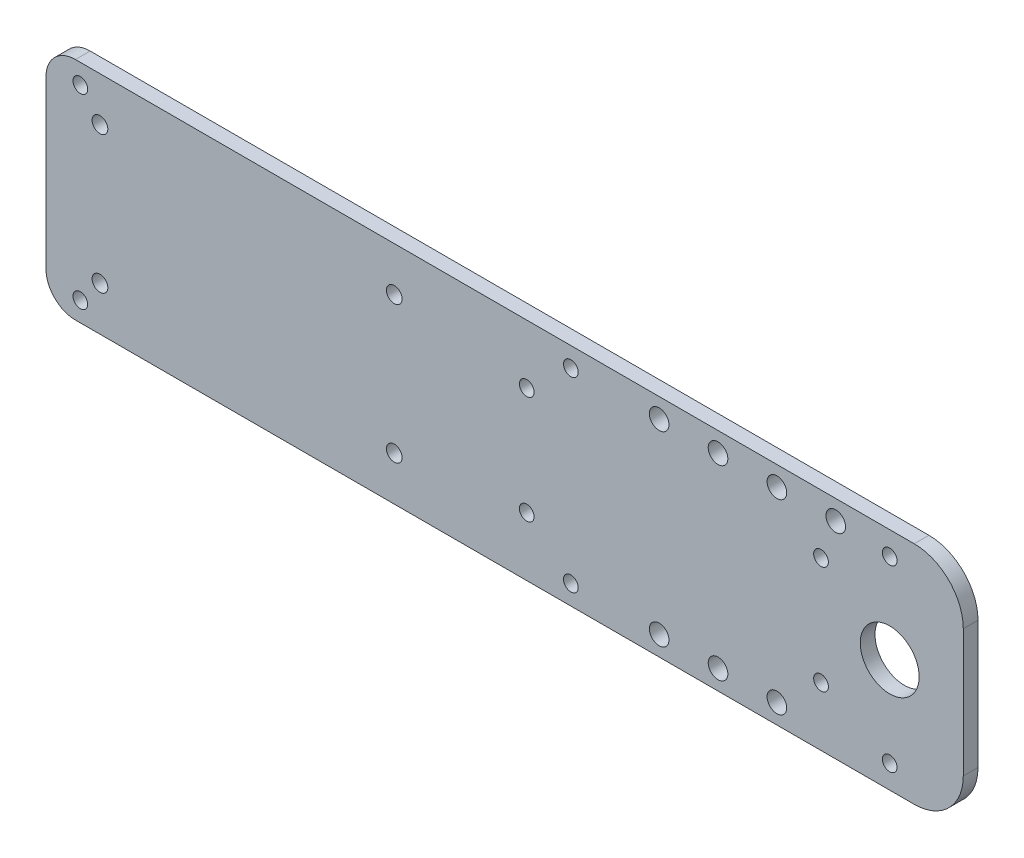
ISO-10303-21;
HEADER;
FILE_DESCRIPTION(('STEP AP214'),'2;1');
FILE_NAME('part.step','',(''),(''),'','','');
FILE_SCHEMA(('AUTOMOTIVE_DESIGN { 1 0 10303 214 1 1 1 1 }'));
ENDSEC;
DATA;
#1=APPLICATION_CONTEXT('core data for automotive mechanical design processes');
#2=APPLICATION_PROTOCOL_DEFINITION('international standard','automotive_design',2000,#1);
#3=PRODUCT_CONTEXT('',#1,'mechanical');
#4=PRODUCT('Part','Part','',(#3));
#5=PRODUCT_RELATED_PRODUCT_CATEGORY('part','',(#4));
#6=PRODUCT_DEFINITION_FORMATION('','',#4);
#7=PRODUCT_DEFINITION_CONTEXT('part definition',#1,'design');
#8=PRODUCT_DEFINITION('design','',#6,#7);
#9=PRODUCT_DEFINITION_SHAPE('','',#8);
#10=(LENGTH_UNIT() NAMED_UNIT(*) SI_UNIT(.MILLI.,.METRE.));
#11=(NAMED_UNIT(*) PLANE_ANGLE_UNIT() SI_UNIT($,.RADIAN.));
#12=(NAMED_UNIT(*) SI_UNIT($,.STERADIAN.) SOLID_ANGLE_UNIT());
#13=UNCERTAINTY_MEASURE_WITH_UNIT(LENGTH_MEASURE(1.E-05),#10,'distance_accuracy_value','');
#14=(GEOMETRIC_REPRESENTATION_CONTEXT(3) GLOBAL_UNCERTAINTY_ASSIGNED_CONTEXT((#13)) GLOBAL_UNIT_ASSIGNED_CONTEXT((#10,
#11,#12)) REPRESENTATION_CONTEXT('',''));
#15=CARTESIAN_POINT('',(0.,0.,0.));
#16=DIRECTION('',(0.,0.,1.));
#17=DIRECTION('',(1.,0.,0.));
#18=AXIS2_PLACEMENT_3D('',#15,#16,#17);
#19=CARTESIAN_POINT('',(0.,0.,3.));
#20=DIRECTION('',(0.,0.,1.));
#21=DIRECTION('',(1.,0.,0.));
#22=AXIS2_PLACEMENT_3D('',#19,#20,#21);
#23=PLANE('',#22);
#24=CARTESIAN_POINT('',(102.,11.,3.));
#25=DIRECTION('',(0.,0.,1.));
#26=DIRECTION('',(1.,0.,0.));
#27=AXIS2_PLACEMENT_3D('',#24,#25,#26);
#28=CIRCLE('',#27,1.5);
#29=CARTESIAN_POINT('',(103.5,11.,3.));
#30=VERTEX_POINT('',#29);
#31=EDGE_CURVE('E318',#30,#30,#28,.F.);
#32=ORIENTED_EDGE('',*,*,#31,.T.);
#33=EDGE_LOOP('',(#32));
#34=FACE_BOUND('',#33,.T.);
#35=CARTESIAN_POINT('',(69.,19.,3.));
#36=DIRECTION('',(0.,0.,1.));
#37=DIRECTION('',(1.,0.,0.));
#38=AXIS2_PLACEMENT_3D('',#35,#36,#37);
#39=CIRCLE('',#38,2.);
#40=CARTESIAN_POINT('',(71.,19.,3.));
#41=VERTEX_POINT('',#40);
#42=EDGE_CURVE('E330',#41,#41,#39,.T.);
#43=ORIENTED_EDGE('',*,*,#42,.F.);
#44=EDGE_LOOP('',(#43));
#45=FACE_BOUND('',#44,.T.);
#46=CARTESIAN_POINT('',(-49.,-19.,3.));
#47=DIRECTION('',(0.,0.,1.));
#48=DIRECTION('',(1.,0.,0.));
#49=AXIS2_PLACEMENT_3D('',#46,#47,#48);
#50=CIRCLE('',#49,1.5);
#51=CARTESIAN_POINT('',(-47.5,-19.,3.));
#52=VERTEX_POINT('',#51);
#53=EDGE_CURVE('E355',#52,#52,#50,.F.);
#54=ORIENTED_EDGE('',*,*,#53,.T.);
#55=EDGE_LOOP('',(#54));
#56=FACE_BOUND('',#55,.T.);
#57=CARTESIAN_POINT('',(69.,-19.,3.));
#58=DIRECTION('',(0.,0.,1.));
#59=DIRECTION('',(1.,0.,0.));
#60=AXIS2_PLACEMENT_3D('',#57,#58,#59);
#61=CIRCLE('',#60,2.);
#62=CARTESIAN_POINT('',(71.,-19.,3.));
#63=VERTEX_POINT('',#62);
#64=EDGE_CURVE('E331',#63,#63,#61,.T.);
#65=ORIENTED_EDGE('',*,*,#64,.F.);
#66=EDGE_LOOP('',(#65));
#67=FACE_BOUND('',#66,.T.);
#68=CARTESIAN_POINT('',(81.,-19.,3.));
#69=DIRECTION('',(0.,0.,1.));
#70=DIRECTION('',(1.,0.,0.));
#71=AXIS2_PLACEMENT_3D('',#68,#69,#70);
#72=CIRCLE('',#71,2.);
#73=CARTESIAN_POINT('',(83.,-19.,3.));
#74=VERTEX_POINT('',#73);
#75=EDGE_CURVE('E337',#74,#74,#72,.T.);
#76=ORIENTED_EDGE('',*,*,#75,.F.);
#77=EDGE_LOOP('',(#76));
#78=FACE_BOUND('',#77,.T.);
#79=CARTESIAN_POINT('',(81.,19.,3.));
#80=DIRECTION('',(0.,0.,1.));
#81=DIRECTION('',(1.,0.,0.));
#82=AXIS2_PLACEMENT_3D('',#79,#80,#81);
#83=CIRCLE('',#82,2.);
#84=CARTESIAN_POINT('',(83.,19.,3.));
#85=VERTEX_POINT('',#84);
#86=EDGE_CURVE('E317',#85,#85,#83,.T.);
#87=ORIENTED_EDGE('',*,*,#86,.F.);
#88=EDGE_LOOP('',(#87));
#89=FACE_BOUND('',#88,.T.);
#90=CARTESIAN_POINT('',(-49.,19.,3.));
#91=DIRECTION('',(0.,0.,1.));
#92=DIRECTION('',(1.,0.,0.));
#93=AXIS2_PLACEMENT_3D('',#90,#91,#92);
#94=CIRCLE('',#93,1.5);
#95=CARTESIAN_POINT('',(-47.5,19.,3.));
#96=VERTEX_POINT('',#95);
#97=EDGE_CURVE('E354',#96,#96,#94,.T.);
#98=ORIENTED_EDGE('',*,*,#97,.F.);
#99=EDGE_LOOP('',(#98));
#100=FACE_BOUND('',#99,.T.);
#101=DIRECTION('',(-1.,0.,0.));
#102=VECTOR('',#101,1.);
#103=CARTESIAN_POINT('',(0.,-23.,3.));
#104=LINE('',#103,#102);
#105=CARTESIAN_POINT('',(121.,-23.,3.));
#106=VERTEX_POINT('',#105);
#107=CARTESIAN_POINT('',(-50.,-23.,3.));
#108=VERTEX_POINT('',#107);
#109=EDGE_CURVE('E124',#106,#108,#104,.T.);
#110=ORIENTED_EDGE('',*,*,#109,.F.);
#111=CARTESIAN_POINT('',(121.,-13.,3.));
#112=DIRECTION('',(0.,0.,1.));
#113=DIRECTION('',(1.,0.,0.));
#114=AXIS2_PLACEMENT_3D('',#111,#112,#113);
#115=CIRCLE('',#114,10.);
#116=CARTESIAN_POINT('',(131.,-13.,3.));
#117=VERTEX_POINT('',#116);
#118=EDGE_CURVE('E151',#106,#117,#115,.T.);
#119=ORIENTED_EDGE('',*,*,#118,.T.);
#120=DIRECTION('',(0.,1.,0.));
#121=VECTOR('',#120,1.);
#122=CARTESIAN_POINT('',(131.,0.,3.));
#123=LINE('',#122,#121);
#124=CARTESIAN_POINT('',(131.,13.,3.));
#125=VERTEX_POINT('',#124);
#126=EDGE_CURVE('E165',#117,#125,#123,.T.);
#127=ORIENTED_EDGE('',*,*,#126,.T.);
#128=CARTESIAN_POINT('',(121.,13.,3.));
#129=DIRECTION('',(0.,0.,1.));
#130=DIRECTION('',(1.,0.,0.));
#131=AXIS2_PLACEMENT_3D('',#128,#129,#130);
#132=CIRCLE('',#131,10.);
#133=CARTESIAN_POINT('',(121.,23.,3.));
#134=VERTEX_POINT('',#133);
#135=EDGE_CURVE('E149',#125,#134,#132,.T.);
#136=ORIENTED_EDGE('',*,*,#135,.T.);
#137=DIRECTION('',(-1.,0.,0.));
#138=VECTOR('',#137,1.);
#139=CARTESIAN_POINT('',(0.,23.,3.));
#140=LINE('',#139,#138);
#141=CARTESIAN_POINT('',(-50.,23.,3.));
#142=VERTEX_POINT('',#141);
#143=EDGE_CURVE('E174',#134,#142,#140,.T.);
#144=ORIENTED_EDGE('',*,*,#143,.T.);
#145=CARTESIAN_POINT('',(-50.,17.,3.));
#146=DIRECTION('',(0.,0.,1.));
#147=DIRECTION('',(1.,0.,0.));
#148=AXIS2_PLACEMENT_3D('',#145,#146,#147);
#149=CIRCLE('',#148,6.);
#150=CARTESIAN_POINT('',(-56.,17.,3.));
#151=VERTEX_POINT('',#150);
#152=EDGE_CURVE('E140',#142,#151,#149,.T.);
#153=ORIENTED_EDGE('',*,*,#152,.T.);
#154=DIRECTION('',(0.,1.,0.));
#155=VECTOR('',#154,1.);
#156=CARTESIAN_POINT('',(-56.,0.,3.));
#157=LINE('',#156,#155);
#158=CARTESIAN_POINT('',(-56.,-17.,3.));
#159=VERTEX_POINT('',#158);
#160=EDGE_CURVE('E176',#159,#151,#157,.T.);
#161=ORIENTED_EDGE('',*,*,#160,.F.);
#162=CARTESIAN_POINT('',(-50.,-17.,3.));
#163=DIRECTION('',(0.,0.,1.));
#164=DIRECTION('',(1.,0.,0.));
#165=AXIS2_PLACEMENT_3D('',#162,#163,#164);
#166=CIRCLE('',#165,6.);
#167=EDGE_CURVE('E142',#159,#108,#166,.T.);
#168=ORIENTED_EDGE('',*,*,#167,.T.);
#169=EDGE_LOOP('',(#110,#119,#127,#136,#144,#153,#161,#168));
#170=FACE_BOUND('',#169,.T.);
#171=CARTESIAN_POINT('',(42.,11.,3.));
#172=DIRECTION('',(0.,0.,1.));
#173=DIRECTION('',(1.,0.,0.));
#174=AXIS2_PLACEMENT_3D('',#171,#172,#173);
#175=CIRCLE('',#174,1.50000000000001);
#176=CARTESIAN_POINT('',(43.5,11.,3.));
#177=VERTEX_POINT('',#176);
#178=EDGE_CURVE('E185',#177,#177,#175,.F.);
#179=ORIENTED_EDGE('',*,*,#178,.T.);
#180=EDGE_LOOP('',(#179));
#181=FACE_BOUND('',#180,.T.);
#182=CARTESIAN_POINT('',(15.,-14.,3.));
#183=DIRECTION('',(0.,0.,1.));
#184=DIRECTION('',(1.,0.,0.));
#185=AXIS2_PLACEMENT_3D('',#182,#183,#184);
#186=CIRCLE('',#185,1.6);
#187=CARTESIAN_POINT('',(16.6,-14.,3.));
#188=VERTEX_POINT('',#187);
#189=EDGE_CURVE('E188',#188,#188,#186,.T.);
#190=ORIENTED_EDGE('',*,*,#189,.F.);
#191=EDGE_LOOP('',(#190));
#192=FACE_BOUND('',#191,.T.);
#193=CARTESIAN_POINT('',(42.,-11.,3.));
#194=DIRECTION('',(0.,0.,1.));
#195=DIRECTION('',(1.,0.,0.));
#196=AXIS2_PLACEMENT_3D('',#193,#194,#195);
#197=CIRCLE('',#196,1.49999999999999);
#198=CARTESIAN_POINT('',(43.5,-11.,3.));
#199=VERTEX_POINT('',#198);
#200=EDGE_CURVE('E191',#199,#199,#197,.T.);
#201=ORIENTED_EDGE('',*,*,#200,.F.);
#202=EDGE_LOOP('',(#201));
#203=FACE_BOUND('',#202,.T.);
#204=CARTESIAN_POINT('',(-45.,14.,3.));
#205=DIRECTION('',(0.,0.,1.));
#206=DIRECTION('',(1.,0.,0.));
#207=AXIS2_PLACEMENT_3D('',#204,#205,#206);
#208=CIRCLE('',#207,1.6);
#209=CARTESIAN_POINT('',(-43.4,14.,3.));
#210=VERTEX_POINT('',#209);
#211=EDGE_CURVE('E194',#210,#210,#208,.T.);
#212=ORIENTED_EDGE('',*,*,#211,.F.);
#213=EDGE_LOOP('',(#212));
#214=FACE_BOUND('',#213,.T.);
#215=CARTESIAN_POINT('',(-45.,-14.,3.));
#216=DIRECTION('',(0.,0.,1.));
#217=DIRECTION('',(1.,0.,0.));
#218=AXIS2_PLACEMENT_3D('',#215,#216,#217);
#219=CIRCLE('',#218,1.6);
#220=CARTESIAN_POINT('',(-43.4,-14.,3.));
#221=VERTEX_POINT('',#220);
#222=EDGE_CURVE('E131',#221,#221,#219,.F.);
#223=ORIENTED_EDGE('',*,*,#222,.T.);
#224=EDGE_LOOP('',(#223));
#225=FACE_BOUND('',#224,.T.);
#226=CARTESIAN_POINT('',(15.,14.,3.));
#227=DIRECTION('',(0.,0.,1.));
#228=DIRECTION('',(1.,0.,0.));
#229=AXIS2_PLACEMENT_3D('',#226,#227,#228);
#230=CIRCLE('',#229,1.6);
#231=CARTESIAN_POINT('',(16.6,14.,3.));
#232=VERTEX_POINT('',#231);
#233=EDGE_CURVE('E126',#232,#232,#230,.F.);
#234=ORIENTED_EDGE('',*,*,#233,.T.);
#235=EDGE_LOOP('',(#234));
#236=FACE_BOUND('',#235,.T.);
#237=CARTESIAN_POINT('',(116.,-18.25,3.));
#238=DIRECTION('',(0.,0.,1.));
#239=DIRECTION('',(1.,0.,0.));
#240=AXIS2_PLACEMENT_3D('',#237,#238,#239);
#241=CIRCLE('',#240,1.5);
#242=CARTESIAN_POINT('',(117.5,-18.25,3.));
#243=VERTEX_POINT('',#242);
#244=EDGE_CURVE('E285',#243,#243,#241,.T.);
#245=ORIENTED_EDGE('',*,*,#244,.F.);
#246=EDGE_LOOP('',(#245));
#247=FACE_BOUND('',#246,.T.);
#248=CARTESIAN_POINT('',(116.,0.,3.));
#249=DIRECTION('',(0.,0.,1.));
#250=DIRECTION('',(1.,0.,0.));
#251=AXIS2_PLACEMENT_3D('',#248,#249,#250);
#252=CIRCLE('',#251,6.);
#253=CARTESIAN_POINT('',(122.,0.,3.));
#254=VERTEX_POINT('',#253);
#255=EDGE_CURVE('E289',#254,#254,#252,.T.);
#256=ORIENTED_EDGE('',*,*,#255,.F.);
#257=EDGE_LOOP('',(#256));
#258=FACE_BOUND('',#257,.T.);
#259=CARTESIAN_POINT('',(93.,-19.,3.));
#260=DIRECTION('',(0.,0.,1.));
#261=DIRECTION('',(1.,0.,0.));
#262=AXIS2_PLACEMENT_3D('',#259,#260,#261);
#263=CIRCLE('',#262,2.);
#264=CARTESIAN_POINT('',(95.,-19.,3.));
#265=VERTEX_POINT('',#264);
#266=EDGE_CURVE('E293',#265,#265,#263,.T.);
#267=ORIENTED_EDGE('',*,*,#266,.F.);
#268=EDGE_LOOP('',(#267));
#269=FACE_BOUND('',#268,.T.);
#270=CARTESIAN_POINT('',(105.,19.,3.));
#271=DIRECTION('',(0.,0.,1.));
#272=DIRECTION('',(1.,0.,0.));
#273=AXIS2_PLACEMENT_3D('',#270,#271,#272);
#274=CIRCLE('',#273,2.);
#275=CARTESIAN_POINT('',(107.,19.,3.));
#276=VERTEX_POINT('',#275);
#277=EDGE_CURVE('E297',#276,#276,#274,.T.);
#278=ORIENTED_EDGE('',*,*,#277,.F.);
#279=EDGE_LOOP('',(#278));
#280=FACE_BOUND('',#279,.T.);
#281=CARTESIAN_POINT('',(93.,19.,3.));
#282=DIRECTION('',(0.,0.,1.));
#283=DIRECTION('',(1.,0.,0.));
#284=AXIS2_PLACEMENT_3D('',#281,#282,#283);
#285=CIRCLE('',#284,2.);
#286=CARTESIAN_POINT('',(95.,19.,3.));
#287=VERTEX_POINT('',#286);
#288=EDGE_CURVE('E301',#287,#287,#285,.F.);
#289=ORIENTED_EDGE('',*,*,#288,.T.);
#290=EDGE_LOOP('',(#289));
#291=FACE_BOUND('',#290,.T.);
#292=CARTESIAN_POINT('',(116.,18.25,3.));
#293=DIRECTION('',(0.,0.,1.));
#294=DIRECTION('',(1.,0.,0.));
#295=AXIS2_PLACEMENT_3D('',#292,#293,#294);
#296=CIRCLE('',#295,1.50000000000001);
#297=CARTESIAN_POINT('',(117.5,18.25,3.));
#298=VERTEX_POINT('',#297);
#299=EDGE_CURVE('E168',#298,#298,#296,.F.);
#300=ORIENTED_EDGE('',*,*,#299,.T.);
#301=EDGE_LOOP('',(#300));
#302=FACE_BOUND('',#301,.T.);
#303=CARTESIAN_POINT('',(51.,19.,3.));
#304=DIRECTION('',(0.,0.,1.));
#305=DIRECTION('',(1.,0.,0.));
#306=AXIS2_PLACEMENT_3D('',#303,#304,#305);
#307=CIRCLE('',#306,1.5);
#308=CARTESIAN_POINT('',(52.5,19.,3.));
#309=VERTEX_POINT('',#308);
#310=EDGE_CURVE('E308',#309,#309,#307,.T.);
#311=ORIENTED_EDGE('',*,*,#310,.F.);
#312=EDGE_LOOP('',(#311));
#313=FACE_BOUND('',#312,.T.);
#314=CARTESIAN_POINT('',(51.,-19.,3.));
#315=DIRECTION('',(0.,0.,1.));
#316=DIRECTION('',(1.,0.,0.));
#317=AXIS2_PLACEMENT_3D('',#314,#315,#316);
#318=CIRCLE('',#317,1.5);
#319=CARTESIAN_POINT('',(52.5,-19.,3.));
#320=VERTEX_POINT('',#319);
#321=EDGE_CURVE('E312',#320,#320,#318,.F.);
#322=ORIENTED_EDGE('',*,*,#321,.T.);
#323=EDGE_LOOP('',(#322));
#324=FACE_BOUND('',#323,.T.);
#325=CARTESIAN_POINT('',(102.,-11.,3.));
#326=DIRECTION('',(0.,0.,1.));
#327=DIRECTION('',(1.,0.,0.));
#328=AXIS2_PLACEMENT_3D('',#325,#326,#327);
#329=CIRCLE('',#328,1.5);
#330=CARTESIAN_POINT('',(103.5,-11.,3.));
#331=VERTEX_POINT('',#330);
#332=EDGE_CURVE('E315',#331,#331,#329,.T.);
#333=ORIENTED_EDGE('',*,*,#332,.F.);
#334=EDGE_LOOP('',(#333));
#335=FACE_BOUND('',#334,.T.);
#336=ADVANCED_FACE('F34',(#34,#45,#56,#67,#78,#89,#100,#170,#181,#192,#203,#214,#225,#236,#247,
#258,#269,#280,#291,#302,#313,#324,#335),#23,.T.);
#337=CARTESIAN_POINT('',(0.,0.,0.));
#338=DIRECTION('',(0.,0.,1.));
#339=DIRECTION('',(1.,0.,0.));
#340=AXIS2_PLACEMENT_3D('',#337,#338,#339);
#341=PLANE('',#340);
#342=CARTESIAN_POINT('',(51.,-19.,0.));
#343=DIRECTION('',(0.,0.,1.));
#344=DIRECTION('',(1.,0.,0.));
#345=AXIS2_PLACEMENT_3D('',#342,#343,#344);
#346=CIRCLE('',#345,1.5);
#347=CARTESIAN_POINT('',(52.5,-19.,0.));
#348=VERTEX_POINT('',#347);
#349=EDGE_CURVE('E342',#348,#348,#346,.F.);
#350=ORIENTED_EDGE('',*,*,#349,.F.);
#351=EDGE_LOOP('',(#350));
#352=FACE_BOUND('',#351,.T.);
#353=CARTESIAN_POINT('',(-49.,-19.,0.));
#354=DIRECTION('',(0.,0.,1.));
#355=DIRECTION('',(1.,0.,0.));
#356=AXIS2_PLACEMENT_3D('',#353,#354,#355);
#357=CIRCLE('',#356,1.5);
#358=CARTESIAN_POINT('',(-47.5,-19.,0.));
#359=VERTEX_POINT('',#358);
#360=EDGE_CURVE('E351',#359,#359,#357,.F.);
#361=ORIENTED_EDGE('',*,*,#360,.F.);
#362=EDGE_LOOP('',(#361));
#363=FACE_BOUND('',#362,.T.);
#364=CARTESIAN_POINT('',(116.,18.25,0.));
#365=DIRECTION('',(0.,0.,1.));
#366=DIRECTION('',(1.,0.,0.));
#367=AXIS2_PLACEMENT_3D('',#364,#365,#366);
#368=CIRCLE('',#367,1.50000000000001);
#369=CARTESIAN_POINT('',(117.5,18.25,0.));
#370=VERTEX_POINT('',#369);
#371=EDGE_CURVE('E110',#370,#370,#368,.F.);
#372=ORIENTED_EDGE('',*,*,#371,.F.);
#373=EDGE_LOOP('',(#372));
#374=FACE_BOUND('',#373,.T.);
#375=CARTESIAN_POINT('',(93.,19.,0.));
#376=DIRECTION('',(0.,0.,1.));
#377=DIRECTION('',(1.,0.,0.));
#378=AXIS2_PLACEMENT_3D('',#375,#376,#377);
#379=CIRCLE('',#378,2.);
#380=CARTESIAN_POINT('',(95.,19.,0.));
#381=VERTEX_POINT('',#380);
#382=EDGE_CURVE('E378',#381,#381,#379,.F.);
#383=ORIENTED_EDGE('',*,*,#382,.F.);
#384=EDGE_LOOP('',(#383));
#385=FACE_BOUND('',#384,.T.);
#386=CARTESIAN_POINT('',(105.,19.,0.));
#387=DIRECTION('',(0.,0.,1.));
#388=DIRECTION('',(1.,0.,0.));
#389=AXIS2_PLACEMENT_3D('',#386,#387,#388);
#390=CIRCLE('',#389,2.);
#391=CARTESIAN_POINT('',(107.,19.,0.));
#392=VERTEX_POINT('',#391);
#393=EDGE_CURVE('E375',#392,#392,#390,.T.);
#394=ORIENTED_EDGE('',*,*,#393,.T.);
#395=EDGE_LOOP('',(#394));
#396=FACE_BOUND('',#395,.T.);
#397=CARTESIAN_POINT('',(93.,-19.,0.));
#398=DIRECTION('',(0.,0.,1.));
#399=DIRECTION('',(1.,0.,0.));
#400=AXIS2_PLACEMENT_3D('',#397,#398,#399);
#401=CIRCLE('',#400,2.);
#402=CARTESIAN_POINT('',(95.,-19.,0.));
#403=VERTEX_POINT('',#402);
#404=EDGE_CURVE('E372',#403,#403,#401,.T.);
#405=ORIENTED_EDGE('',*,*,#404,.T.);
#406=EDGE_LOOP('',(#405));
#407=FACE_BOUND('',#406,.T.);
#408=CARTESIAN_POINT('',(116.,0.,0.));
#409=DIRECTION('',(0.,0.,1.));
#410=DIRECTION('',(1.,0.,0.));
#411=AXIS2_PLACEMENT_3D('',#408,#409,#410);
#412=CIRCLE('',#411,6.);
#413=CARTESIAN_POINT('',(122.,0.,0.));
#414=VERTEX_POINT('',#413);
#415=EDGE_CURVE('E369',#414,#414,#412,.T.);
#416=ORIENTED_EDGE('',*,*,#415,.T.);
#417=EDGE_LOOP('',(#416));
#418=FACE_BOUND('',#417,.T.);
#419=CARTESIAN_POINT('',(116.,-18.25,0.));
#420=DIRECTION('',(0.,0.,1.));
#421=DIRECTION('',(1.,0.,0.));
#422=AXIS2_PLACEMENT_3D('',#419,#420,#421);
#423=CIRCLE('',#422,1.5);
#424=CARTESIAN_POINT('',(117.5,-18.25,0.));
#425=VERTEX_POINT('',#424);
#426=EDGE_CURVE('E167',#425,#425,#423,.T.);
#427=ORIENTED_EDGE('',*,*,#426,.T.);
#428=EDGE_LOOP('',(#427));
#429=FACE_BOUND('',#428,.T.);
#430=CARTESIAN_POINT('',(15.,14.,0.));
#431=DIRECTION('',(0.,0.,1.));
#432=DIRECTION('',(1.,0.,0.));
#433=AXIS2_PLACEMENT_3D('',#430,#431,#432);
#434=CIRCLE('',#433,1.6);
#435=CARTESIAN_POINT('',(16.6,14.,0.));
#436=VERTEX_POINT('',#435);
#437=EDGE_CURVE('E134',#436,#436,#434,.F.);
#438=ORIENTED_EDGE('',*,*,#437,.F.);
#439=EDGE_LOOP('',(#438));
#440=FACE_BOUND('',#439,.T.);
#441=CARTESIAN_POINT('',(-45.,-14.,0.));
#442=DIRECTION('',(0.,0.,1.));
#443=DIRECTION('',(1.,0.,0.));
#444=AXIS2_PLACEMENT_3D('',#441,#442,#443);
#445=CIRCLE('',#444,1.6);
#446=CARTESIAN_POINT('',(-43.4,-14.,0.));
#447=VERTEX_POINT('',#446);
#448=EDGE_CURVE('E179',#447,#447,#445,.F.);
#449=ORIENTED_EDGE('',*,*,#448,.F.);
#450=EDGE_LOOP('',(#449));
#451=FACE_BOUND('',#450,.T.);
#452=CARTESIAN_POINT('',(-45.,14.,0.));
#453=DIRECTION('',(0.,0.,1.));
#454=DIRECTION('',(1.,0.,0.));
#455=AXIS2_PLACEMENT_3D('',#452,#453,#454);
#456=CIRCLE('',#455,1.6);
#457=CARTESIAN_POINT('',(-43.4,14.,0.));
#458=VERTEX_POINT('',#457);
#459=EDGE_CURVE('E211',#458,#458,#456,.T.);
#460=ORIENTED_EDGE('',*,*,#459,.T.);
#461=EDGE_LOOP('',(#460));
#462=FACE_BOUND('',#461,.T.);
#463=CARTESIAN_POINT('',(42.,-11.,0.));
#464=DIRECTION('',(0.,0.,1.));
#465=DIRECTION('',(1.,0.,0.));
#466=AXIS2_PLACEMENT_3D('',#463,#464,#465);
#467=CIRCLE('',#466,1.49999999999999);
#468=CARTESIAN_POINT('',(43.5,-11.,0.));
#469=VERTEX_POINT('',#468);
#470=EDGE_CURVE('E208',#469,#469,#467,.T.);
#471=ORIENTED_EDGE('',*,*,#470,.T.);
#472=EDGE_LOOP('',(#471));
#473=FACE_BOUND('',#472,.T.);
#474=CARTESIAN_POINT('',(15.,-14.,0.));
#475=DIRECTION('',(0.,0.,1.));
#476=DIRECTION('',(1.,0.,0.));
#477=AXIS2_PLACEMENT_3D('',#474,#475,#476);
#478=CIRCLE('',#477,1.6);
#479=CARTESIAN_POINT('',(16.6,-14.,0.));
#480=VERTEX_POINT('',#479);
#481=EDGE_CURVE('E205',#480,#480,#478,.T.);
#482=ORIENTED_EDGE('',*,*,#481,.T.);
#483=EDGE_LOOP('',(#482));
#484=FACE_BOUND('',#483,.T.);
#485=CARTESIAN_POINT('',(42.,11.,0.));
#486=DIRECTION('',(0.,0.,1.));
#487=DIRECTION('',(1.,0.,0.));
#488=AXIS2_PLACEMENT_3D('',#485,#486,#487);
#489=CIRCLE('',#488,1.50000000000001);
#490=CARTESIAN_POINT('',(43.5,11.,0.));
#491=VERTEX_POINT('',#490);
#492=EDGE_CURVE('E202',#491,#491,#489,.F.);
#493=ORIENTED_EDGE('',*,*,#492,.F.);
#494=EDGE_LOOP('',(#493));
#495=FACE_BOUND('',#494,.T.);
#496=DIRECTION('',(0.,1.,0.));
#497=VECTOR('',#496,1.);
#498=CARTESIAN_POINT('',(131.,0.,0.));
#499=LINE('',#498,#497);
#500=CARTESIAN_POINT('',(131.,-13.,0.));
#501=VERTEX_POINT('',#500);
#502=CARTESIAN_POINT('',(131.,13.,0.));
#503=VERTEX_POINT('',#502);
#504=EDGE_CURVE('E162',#501,#503,#499,.T.);
#505=ORIENTED_EDGE('',*,*,#504,.F.);
#506=CARTESIAN_POINT('',(121.,-13.,0.));
#507=DIRECTION('',(0.,0.,1.));
#508=DIRECTION('',(1.,0.,0.));
#509=AXIS2_PLACEMENT_3D('',#506,#507,#508);
#510=CIRCLE('',#509,10.);
#511=CARTESIAN_POINT('',(121.,-23.,0.));
#512=VERTEX_POINT('',#511);
#513=EDGE_CURVE('E42',#501,#512,#510,.F.);
#514=ORIENTED_EDGE('',*,*,#513,.T.);
#515=DIRECTION('',(-1.,0.,0.));
#516=VECTOR('',#515,1.);
#517=CARTESIAN_POINT('',(0.,-23.,0.));
#518=LINE('',#517,#516);
#519=CARTESIAN_POINT('',(-50.,-23.,0.));
#520=VERTEX_POINT('',#519);
#521=EDGE_CURVE('E97',#512,#520,#518,.T.);
#522=ORIENTED_EDGE('',*,*,#521,.T.);
#523=CARTESIAN_POINT('',(-50.,-17.,0.));
#524=DIRECTION('',(0.,0.,1.));
#525=DIRECTION('',(1.,0.,0.));
#526=AXIS2_PLACEMENT_3D('',#523,#524,#525);
#527=CIRCLE('',#526,6.);
#528=CARTESIAN_POINT('',(-56.,-17.,0.));
#529=VERTEX_POINT('',#528);
#530=EDGE_CURVE('E102',#520,#529,#527,.F.);
#531=ORIENTED_EDGE('',*,*,#530,.T.);
#532=DIRECTION('',(0.,1.,0.));
#533=VECTOR('',#532,1.);
#534=CARTESIAN_POINT('',(-56.,0.,0.));
#535=LINE('',#534,#533);
#536=CARTESIAN_POINT('',(-56.,17.,0.));
#537=VERTEX_POINT('',#536);
#538=EDGE_CURVE('E200',#529,#537,#535,.T.);
#539=ORIENTED_EDGE('',*,*,#538,.T.);
#540=CARTESIAN_POINT('',(-50.,17.,0.));
#541=DIRECTION('',(0.,0.,1.));
#542=DIRECTION('',(1.,0.,0.));
#543=AXIS2_PLACEMENT_3D('',#540,#541,#542);
#544=CIRCLE('',#543,6.);
#545=CARTESIAN_POINT('',(-50.,23.,0.));
#546=VERTEX_POINT('',#545);
#547=EDGE_CURVE('E120',#537,#546,#544,.F.);
#548=ORIENTED_EDGE('',*,*,#547,.T.);
#549=DIRECTION('',(-1.,0.,0.));
#550=VECTOR('',#549,1.);
#551=CARTESIAN_POINT('',(0.,23.,0.));
#552=LINE('',#551,#550);
#553=CARTESIAN_POINT('',(121.,23.,0.));
#554=VERTEX_POINT('',#553);
#555=EDGE_CURVE('E109',#554,#546,#552,.T.);
#556=ORIENTED_EDGE('',*,*,#555,.F.);
#557=CARTESIAN_POINT('',(121.,13.,0.));
#558=DIRECTION('',(0.,0.,1.));
#559=DIRECTION('',(1.,0.,0.));
#560=AXIS2_PLACEMENT_3D('',#557,#558,#559);
#561=CIRCLE('',#560,10.);
#562=EDGE_CURVE('E54',#554,#503,#561,.F.);
#563=ORIENTED_EDGE('',*,*,#562,.T.);
#564=EDGE_LOOP('',(#505,#514,#522,#531,#539,#548,#556,#563));
#565=FACE_BOUND('',#564,.T.);
#566=CARTESIAN_POINT('',(-49.,19.,0.));
#567=DIRECTION('',(0.,0.,1.));
#568=DIRECTION('',(1.,0.,0.));
#569=AXIS2_PLACEMENT_3D('',#566,#567,#568);
#570=CIRCLE('',#569,1.5);
#571=CARTESIAN_POINT('',(-47.5,19.,0.));
#572=VERTEX_POINT('',#571);
#573=EDGE_CURVE('E362',#572,#572,#570,.T.);
#574=ORIENTED_EDGE('',*,*,#573,.T.);
#575=EDGE_LOOP('',(#574));
#576=FACE_BOUND('',#575,.T.);
#577=CARTESIAN_POINT('',(81.,19.,0.));
#578=DIRECTION('',(0.,0.,1.));
#579=DIRECTION('',(1.,0.,0.));
#580=AXIS2_PLACEMENT_3D('',#577,#578,#579);
#581=CIRCLE('',#580,2.);
#582=CARTESIAN_POINT('',(83.,19.,0.));
#583=VERTEX_POINT('',#582);
#584=EDGE_CURVE('E321',#583,#583,#581,.T.);
#585=ORIENTED_EDGE('',*,*,#584,.T.);
#586=EDGE_LOOP('',(#585));
#587=FACE_BOUND('',#586,.T.);
#588=CARTESIAN_POINT('',(81.,-19.,0.));
#589=DIRECTION('',(0.,0.,1.));
#590=DIRECTION('',(1.,0.,0.));
#591=AXIS2_PLACEMENT_3D('',#588,#589,#590);
#592=CIRCLE('',#591,2.);
#593=CARTESIAN_POINT('',(83.,-19.,0.));
#594=VERTEX_POINT('',#593);
#595=EDGE_CURVE('E334',#594,#594,#592,.T.);
#596=ORIENTED_EDGE('',*,*,#595,.T.);
#597=EDGE_LOOP('',(#596));
#598=FACE_BOUND('',#597,.T.);
#599=CARTESIAN_POINT('',(69.,-19.,0.));
#600=DIRECTION('',(0.,0.,1.));
#601=DIRECTION('',(1.,0.,0.));
#602=AXIS2_PLACEMENT_3D('',#599,#600,#601);
#603=CIRCLE('',#602,2.);
#604=CARTESIAN_POINT('',(71.,-19.,0.));
#605=VERTEX_POINT('',#604);
#606=EDGE_CURVE('E327',#605,#605,#603,.T.);
#607=ORIENTED_EDGE('',*,*,#606,.T.);
#608=EDGE_LOOP('',(#607));
#609=FACE_BOUND('',#608,.T.);
#610=CARTESIAN_POINT('',(51.,19.,0.));
#611=DIRECTION('',(0.,0.,1.));
#612=DIRECTION('',(1.,0.,0.));
#613=AXIS2_PLACEMENT_3D('',#610,#611,#612);
#614=CIRCLE('',#613,1.5);
#615=CARTESIAN_POINT('',(52.5,19.,0.));
#616=VERTEX_POINT('',#615);
#617=EDGE_CURVE('E358',#616,#616,#614,.T.);
#618=ORIENTED_EDGE('',*,*,#617,.T.);
#619=EDGE_LOOP('',(#618));
#620=FACE_BOUND('',#619,.T.);
#621=CARTESIAN_POINT('',(69.,19.,0.));
#622=DIRECTION('',(0.,0.,1.));
#623=DIRECTION('',(1.,0.,0.));
#624=AXIS2_PLACEMENT_3D('',#621,#622,#623);
#625=CIRCLE('',#624,2.);
#626=CARTESIAN_POINT('',(71.,19.,0.));
#627=VERTEX_POINT('',#626);
#628=EDGE_CURVE('E346',#627,#627,#625,.T.);
#629=ORIENTED_EDGE('',*,*,#628,.T.);
#630=EDGE_LOOP('',(#629));
#631=FACE_BOUND('',#630,.T.);
#632=CARTESIAN_POINT('',(102.,11.,0.));
#633=DIRECTION('',(0.,0.,1.));
#634=DIRECTION('',(1.,0.,0.));
#635=AXIS2_PLACEMENT_3D('',#632,#633,#634);
#636=CIRCLE('',#635,1.5);
#637=CARTESIAN_POINT('',(103.5,11.,0.));
#638=VERTEX_POINT('',#637);
#639=EDGE_CURVE('E470',#638,#638,#636,.T.);
#640=ORIENTED_EDGE('',*,*,#639,.T.);
#641=EDGE_LOOP('',(#640));
#642=FACE_BOUND('',#641,.T.);
#643=CARTESIAN_POINT('',(102.,-11.,0.));
#644=DIRECTION('',(0.,0.,-1.));
#645=DIRECTION('',(-1.,0.,0.));
#646=AXIS2_PLACEMENT_3D('',#643,#644,#645);
#647=CIRCLE('',#646,1.5);
#648=CARTESIAN_POINT('',(100.5,-11.,0.));
#649=VERTEX_POINT('',#648);
#650=EDGE_CURVE('E323',#649,#649,#647,.T.);
#651=ORIENTED_EDGE('',*,*,#650,.F.);
#652=EDGE_LOOP('',(#651));
#653=FACE_BOUND('',#652,.T.);
#654=ADVANCED_FACE('F99',(#352,#363,#374,#385,#396,#407,#418,#429,#440,#451,#462,#473,#484,#495,
#565,#576,#587,#598,#609,#620,#631,#642,#653),#341,.F.);
#655=CARTESIAN_POINT('',(0.,-23.,3.));
#656=DIRECTION('',(0.,-1.,0.));
#657=DIRECTION('',(1.,0.,0.));
#658=AXIS2_PLACEMENT_3D('',#655,#656,#657);
#659=PLANE('',#658);
#660=ORIENTED_EDGE('',*,*,#521,.F.);
#661=DIRECTION('',(0.,0.,1.));
#662=VECTOR('',#661,1.);
#663=CARTESIAN_POINT('',(121.,-23.,3.));
#664=LINE('',#663,#662);
#665=EDGE_CURVE('E147',#512,#106,#664,.T.);
#666=ORIENTED_EDGE('',*,*,#665,.T.);
#667=ORIENTED_EDGE('',*,*,#109,.T.);
#668=DIRECTION('',(0.,0.,-1.));
#669=VECTOR('',#668,1.);
#670=CARTESIAN_POINT('',(-50.,-23.,3.));
#671=LINE('',#670,#669);
#672=EDGE_CURVE('E117',#108,#520,#671,.T.);
#673=ORIENTED_EDGE('',*,*,#672,.T.);
#674=EDGE_LOOP('',(#660,#666,#667,#673));
#675=FACE_BOUND('',#674,.T.);
#676=ADVANCED_FACE('F122',(#675),#659,.T.);
#677=CARTESIAN_POINT('',(0.,23.,3.));
#678=DIRECTION('',(0.,-1.,0.));
#679=DIRECTION('',(1.,0.,0.));
#680=AXIS2_PLACEMENT_3D('',#677,#678,#679);
#681=PLANE('',#680);
#682=ORIENTED_EDGE('',*,*,#143,.F.);
#683=DIRECTION('',(0.,0.,1.));
#684=VECTOR('',#683,1.);
#685=CARTESIAN_POINT('',(121.,23.,0.));
#686=LINE('',#685,#684);
#687=EDGE_CURVE('E11',#134,#554,#686,.F.);
#688=ORIENTED_EDGE('',*,*,#687,.T.);
#689=ORIENTED_EDGE('',*,*,#555,.T.);
#690=DIRECTION('',(0.,0.,-1.));
#691=VECTOR('',#690,1.);
#692=CARTESIAN_POINT('',(-50.,23.,3.));
#693=LINE('',#692,#691);
#694=EDGE_CURVE('E144',#546,#142,#693,.F.);
#695=ORIENTED_EDGE('',*,*,#694,.T.);
#696=EDGE_LOOP('',(#682,#688,#689,#695));
#697=FACE_BOUND('',#696,.T.);
#698=ADVANCED_FACE('F263',(#697),#681,.F.);
#699=CARTESIAN_POINT('',(-45.,-14.,3.));
#700=DIRECTION('',(0.,0.,-1.));
#701=DIRECTION('',(-1.,0.,0.));
#702=AXIS2_PLACEMENT_3D('',#699,#700,#701);
#703=CYLINDRICAL_SURFACE('',#702,1.6);
#704=ORIENTED_EDGE('',*,*,#222,.F.);
#705=EDGE_LOOP('',(#704));
#706=FACE_BOUND('',#705,.T.);
#707=ORIENTED_EDGE('',*,*,#448,.T.);
#708=EDGE_LOOP('',(#707));
#709=FACE_BOUND('',#708,.T.);
#710=ADVANCED_FACE('F216',(#706,#709),#703,.F.);
#711=CARTESIAN_POINT('',(-45.,14.,3.));
#712=DIRECTION('',(0.,0.,-1.));
#713=DIRECTION('',(-1.,0.,0.));
#714=AXIS2_PLACEMENT_3D('',#711,#712,#713);
#715=CYLINDRICAL_SURFACE('',#714,1.6);
#716=ORIENTED_EDGE('',*,*,#211,.T.);
#717=EDGE_LOOP('',(#716));
#718=FACE_BOUND('',#717,.T.);
#719=ORIENTED_EDGE('',*,*,#459,.F.);
#720=EDGE_LOOP('',(#719));
#721=FACE_BOUND('',#720,.T.);
#722=ADVANCED_FACE('F262',(#718,#721),#715,.F.);
#723=CARTESIAN_POINT('',(42.,-11.,3.));
#724=DIRECTION('',(0.,0.,-1.));
#725=DIRECTION('',(-1.,0.,0.));
#726=AXIS2_PLACEMENT_3D('',#723,#724,#725);
#727=CYLINDRICAL_SURFACE('',#726,1.49999999999999);
#728=ORIENTED_EDGE('',*,*,#200,.T.);
#729=EDGE_LOOP('',(#728));
#730=FACE_BOUND('',#729,.T.);
#731=ORIENTED_EDGE('',*,*,#470,.F.);
#732=EDGE_LOOP('',(#731));
#733=FACE_BOUND('',#732,.T.);
#734=ADVANCED_FACE('F243',(#730,#733),#727,.F.);
#735=CARTESIAN_POINT('',(15.,-14.,3.));
#736=DIRECTION('',(0.,0.,-1.));
#737=DIRECTION('',(-1.,0.,0.));
#738=AXIS2_PLACEMENT_3D('',#735,#736,#737);
#739=CYLINDRICAL_SURFACE('',#738,1.6);
#740=ORIENTED_EDGE('',*,*,#189,.T.);
#741=EDGE_LOOP('',(#740));
#742=FACE_BOUND('',#741,.T.);
#743=ORIENTED_EDGE('',*,*,#481,.F.);
#744=EDGE_LOOP('',(#743));
#745=FACE_BOUND('',#744,.T.);
#746=ADVANCED_FACE('F233',(#742,#745),#739,.F.);
#747=CARTESIAN_POINT('',(42.,11.,3.));
#748=DIRECTION('',(0.,0.,-1.));
#749=DIRECTION('',(-1.,0.,0.));
#750=AXIS2_PLACEMENT_3D('',#747,#748,#749);
#751=CYLINDRICAL_SURFACE('',#750,1.50000000000001);
#752=ORIENTED_EDGE('',*,*,#178,.F.);
#753=EDGE_LOOP('',(#752));
#754=FACE_BOUND('',#753,.T.);
#755=ORIENTED_EDGE('',*,*,#492,.T.);
#756=EDGE_LOOP('',(#755));
#757=FACE_BOUND('',#756,.T.);
#758=ADVANCED_FACE('F230',(#754,#757),#751,.F.);
#759=CARTESIAN_POINT('',(-56.,0.,3.));
#760=DIRECTION('',(-1.,0.,0.));
#761=DIRECTION('',(0.,-1.,0.));
#762=AXIS2_PLACEMENT_3D('',#759,#760,#761);
#763=PLANE('',#762);
#764=ORIENTED_EDGE('',*,*,#538,.F.);
#765=DIRECTION('',(0.,0.,-1.));
#766=VECTOR('',#765,1.);
#767=CARTESIAN_POINT('',(-56.,-17.,3.));
#768=LINE('',#767,#766);
#769=EDGE_CURVE('E118',#529,#159,#768,.F.);
#770=ORIENTED_EDGE('',*,*,#769,.T.);
#771=ORIENTED_EDGE('',*,*,#160,.T.);
#772=DIRECTION('',(0.,0.,-1.));
#773=VECTOR('',#772,1.);
#774=CARTESIAN_POINT('',(-56.,17.,0.));
#775=LINE('',#774,#773);
#776=EDGE_CURVE('E119',#151,#537,#775,.T.);
#777=ORIENTED_EDGE('',*,*,#776,.T.);
#778=EDGE_LOOP('',(#764,#770,#771,#777));
#779=FACE_BOUND('',#778,.T.);
#780=ADVANCED_FACE('F232',(#779),#763,.T.);
#781=CARTESIAN_POINT('',(15.,14.,3.));
#782=DIRECTION('',(0.,0.,-1.));
#783=DIRECTION('',(-1.,0.,0.));
#784=AXIS2_PLACEMENT_3D('',#781,#782,#783);
#785=CYLINDRICAL_SURFACE('',#784,1.6);
#786=ORIENTED_EDGE('',*,*,#233,.F.);
#787=EDGE_LOOP('',(#786));
#788=FACE_BOUND('',#787,.T.);
#789=ORIENTED_EDGE('',*,*,#437,.T.);
#790=EDGE_LOOP('',(#789));
#791=FACE_BOUND('',#790,.T.);
#792=ADVANCED_FACE('F240',(#788,#791),#785,.F.);
#793=CARTESIAN_POINT('',(-50.,-17.,3.));
#794=DIRECTION('',(0.,0.,-1.));
#795=DIRECTION('',(-1.,0.,0.));
#796=AXIS2_PLACEMENT_3D('',#793,#794,#795);
#797=CYLINDRICAL_SURFACE('',#796,6.);
#798=ORIENTED_EDGE('',*,*,#167,.F.);
#799=ORIENTED_EDGE('',*,*,#769,.F.);
#800=ORIENTED_EDGE('',*,*,#530,.F.);
#801=ORIENTED_EDGE('',*,*,#672,.F.);
#802=EDGE_LOOP('',(#798,#799,#800,#801));
#803=FACE_BOUND('',#802,.T.);
#804=ADVANCED_FACE('F116',(#803),#797,.T.);
#805=CARTESIAN_POINT('',(-50.,17.,3.));
#806=DIRECTION('',(0.,0.,1.));
#807=DIRECTION('',(1.,0.,0.));
#808=AXIS2_PLACEMENT_3D('',#805,#806,#807);
#809=CYLINDRICAL_SURFACE('',#808,6.);
#810=ORIENTED_EDGE('',*,*,#152,.F.);
#811=ORIENTED_EDGE('',*,*,#694,.F.);
#812=ORIENTED_EDGE('',*,*,#547,.F.);
#813=ORIENTED_EDGE('',*,*,#776,.F.);
#814=EDGE_LOOP('',(#810,#811,#812,#813));
#815=FACE_BOUND('',#814,.T.);
#816=ADVANCED_FACE('F563',(#815),#809,.T.);
#817=CARTESIAN_POINT('',(131.,0.,0.));
#818=DIRECTION('',(1.,0.,0.));
#819=DIRECTION('',(0.,0.,-1.));
#820=AXIS2_PLACEMENT_3D('',#817,#818,#819);
#821=PLANE('',#820);
#822=ORIENTED_EDGE('',*,*,#126,.F.);
#823=DIRECTION('',(0.,0.,1.));
#824=VECTOR('',#823,1.);
#825=CARTESIAN_POINT('',(131.,-13.,0.));
#826=LINE('',#825,#824);
#827=EDGE_CURVE('E156',#117,#501,#826,.F.);
#828=ORIENTED_EDGE('',*,*,#827,.T.);
#829=ORIENTED_EDGE('',*,*,#504,.T.);
#830=DIRECTION('',(0.,0.,1.));
#831=VECTOR('',#830,1.);
#832=CARTESIAN_POINT('',(131.,13.,3.));
#833=LINE('',#832,#831);
#834=EDGE_CURVE('E153',#503,#125,#833,.T.);
#835=ORIENTED_EDGE('',*,*,#834,.T.);
#836=EDGE_LOOP('',(#822,#828,#829,#835));
#837=FACE_BOUND('',#836,.T.);
#838=ADVANCED_FACE('F161',(#837),#821,.T.);
#839=CARTESIAN_POINT('',(93.,19.,0.));
#840=DIRECTION('',(0.,0.,1.));
#841=DIRECTION('',(1.,0.,0.));
#842=AXIS2_PLACEMENT_3D('',#839,#840,#841);
#843=CYLINDRICAL_SURFACE('',#842,2.);
#844=ORIENTED_EDGE('',*,*,#382,.T.);
#845=EDGE_LOOP('',(#844));
#846=FACE_BOUND('',#845,.T.);
#847=ORIENTED_EDGE('',*,*,#288,.F.);
#848=EDGE_LOOP('',(#847));
#849=FACE_BOUND('',#848,.T.);
#850=ADVANCED_FACE('F391',(#846,#849),#843,.F.);
#851=CARTESIAN_POINT('',(105.,19.,0.));
#852=DIRECTION('',(0.,0.,1.));
#853=DIRECTION('',(1.,0.,0.));
#854=AXIS2_PLACEMENT_3D('',#851,#852,#853);
#855=CYLINDRICAL_SURFACE('',#854,2.);
#856=ORIENTED_EDGE('',*,*,#393,.F.);
#857=EDGE_LOOP('',(#856));
#858=FACE_BOUND('',#857,.T.);
#859=ORIENTED_EDGE('',*,*,#277,.T.);
#860=EDGE_LOOP('',(#859));
#861=FACE_BOUND('',#860,.T.);
#862=ADVANCED_FACE('F388',(#858,#861),#855,.F.);
#863=CARTESIAN_POINT('',(93.,-19.,0.));
#864=DIRECTION('',(0.,0.,1.));
#865=DIRECTION('',(1.,0.,0.));
#866=AXIS2_PLACEMENT_3D('',#863,#864,#865);
#867=CYLINDRICAL_SURFACE('',#866,2.);
#868=ORIENTED_EDGE('',*,*,#404,.F.);
#869=EDGE_LOOP('',(#868));
#870=FACE_BOUND('',#869,.T.);
#871=ORIENTED_EDGE('',*,*,#266,.T.);
#872=EDGE_LOOP('',(#871));
#873=FACE_BOUND('',#872,.T.);
#874=ADVANCED_FACE('F390',(#870,#873),#867,.F.);
#875=CARTESIAN_POINT('',(116.,0.,0.));
#876=DIRECTION('',(0.,0.,1.));
#877=DIRECTION('',(1.,0.,0.));
#878=AXIS2_PLACEMENT_3D('',#875,#876,#877);
#879=CYLINDRICAL_SURFACE('',#878,6.);
#880=ORIENTED_EDGE('',*,*,#415,.F.);
#881=EDGE_LOOP('',(#880));
#882=FACE_BOUND('',#881,.T.);
#883=ORIENTED_EDGE('',*,*,#255,.T.);
#884=EDGE_LOOP('',(#883));
#885=FACE_BOUND('',#884,.T.);
#886=ADVANCED_FACE('F398',(#882,#885),#879,.F.);
#887=CARTESIAN_POINT('',(116.,-18.25,0.));
#888=DIRECTION('',(0.,0.,1.));
#889=DIRECTION('',(1.,0.,0.));
#890=AXIS2_PLACEMENT_3D('',#887,#888,#889);
#891=CYLINDRICAL_SURFACE('',#890,1.5);
#892=ORIENTED_EDGE('',*,*,#426,.F.);
#893=EDGE_LOOP('',(#892));
#894=FACE_BOUND('',#893,.T.);
#895=ORIENTED_EDGE('',*,*,#244,.T.);
#896=EDGE_LOOP('',(#895));
#897=FACE_BOUND('',#896,.T.);
#898=ADVANCED_FACE('F407',(#894,#897),#891,.F.);
#899=CARTESIAN_POINT('',(116.,18.25,0.));
#900=DIRECTION('',(0.,0.,1.));
#901=DIRECTION('',(1.,0.,0.));
#902=AXIS2_PLACEMENT_3D('',#899,#900,#901);
#903=CYLINDRICAL_SURFACE('',#902,1.50000000000001);
#904=ORIENTED_EDGE('',*,*,#371,.T.);
#905=EDGE_LOOP('',(#904));
#906=FACE_BOUND('',#905,.T.);
#907=ORIENTED_EDGE('',*,*,#299,.F.);
#908=EDGE_LOOP('',(#907));
#909=FACE_BOUND('',#908,.T.);
#910=ADVANCED_FACE('F410',(#906,#909),#903,.F.);
#911=CARTESIAN_POINT('',(-49.,19.,0.));
#912=DIRECTION('',(0.,0.,1.));
#913=DIRECTION('',(1.,0.,0.));
#914=AXIS2_PLACEMENT_3D('',#911,#912,#913);
#915=CYLINDRICAL_SURFACE('',#914,1.5);
#916=ORIENTED_EDGE('',*,*,#573,.F.);
#917=EDGE_LOOP('',(#916));
#918=FACE_BOUND('',#917,.T.);
#919=ORIENTED_EDGE('',*,*,#97,.T.);
#920=EDGE_LOOP('',(#919));
#921=FACE_BOUND('',#920,.T.);
#922=ADVANCED_FACE('F415',(#918,#921),#915,.F.);
#923=CARTESIAN_POINT('',(81.,19.,0.));
#924=DIRECTION('',(0.,0.,1.));
#925=DIRECTION('',(1.,0.,0.));
#926=AXIS2_PLACEMENT_3D('',#923,#924,#925);
#927=CYLINDRICAL_SURFACE('',#926,2.);
#928=ORIENTED_EDGE('',*,*,#584,.F.);
#929=EDGE_LOOP('',(#928));
#930=FACE_BOUND('',#929,.T.);
#931=ORIENTED_EDGE('',*,*,#86,.T.);
#932=EDGE_LOOP('',(#931));
#933=FACE_BOUND('',#932,.T.);
#934=ADVANCED_FACE('F426',(#930,#933),#927,.F.);
#935=CARTESIAN_POINT('',(81.,-19.,0.));
#936=DIRECTION('',(0.,0.,1.));
#937=DIRECTION('',(1.,0.,0.));
#938=AXIS2_PLACEMENT_3D('',#935,#936,#937);
#939=CYLINDRICAL_SURFACE('',#938,2.);
#940=ORIENTED_EDGE('',*,*,#595,.F.);
#941=EDGE_LOOP('',(#940));
#942=FACE_BOUND('',#941,.T.);
#943=ORIENTED_EDGE('',*,*,#75,.T.);
#944=EDGE_LOOP('',(#943));
#945=FACE_BOUND('',#944,.T.);
#946=ADVANCED_FACE('F450',(#942,#945),#939,.F.);
#947=CARTESIAN_POINT('',(69.,-19.,0.));
#948=DIRECTION('',(0.,0.,1.));
#949=DIRECTION('',(1.,0.,0.));
#950=AXIS2_PLACEMENT_3D('',#947,#948,#949);
#951=CYLINDRICAL_SURFACE('',#950,2.);
#952=ORIENTED_EDGE('',*,*,#606,.F.);
#953=EDGE_LOOP('',(#952));
#954=FACE_BOUND('',#953,.T.);
#955=ORIENTED_EDGE('',*,*,#64,.T.);
#956=EDGE_LOOP('',(#955));
#957=FACE_BOUND('',#956,.T.);
#958=ADVANCED_FACE('F439',(#954,#957),#951,.F.);
#959=CARTESIAN_POINT('',(-49.,-19.,0.));
#960=DIRECTION('',(0.,0.,1.));
#961=DIRECTION('',(1.,0.,0.));
#962=AXIS2_PLACEMENT_3D('',#959,#960,#961);
#963=CYLINDRICAL_SURFACE('',#962,1.5);
#964=ORIENTED_EDGE('',*,*,#360,.T.);
#965=EDGE_LOOP('',(#964));
#966=FACE_BOUND('',#965,.T.);
#967=ORIENTED_EDGE('',*,*,#53,.F.);
#968=EDGE_LOOP('',(#967));
#969=FACE_BOUND('',#968,.T.);
#970=ADVANCED_FACE('F435',(#966,#969),#963,.F.);
#971=CARTESIAN_POINT('',(51.,19.,0.));
#972=DIRECTION('',(0.,0.,1.));
#973=DIRECTION('',(1.,0.,0.));
#974=AXIS2_PLACEMENT_3D('',#971,#972,#973);
#975=CYLINDRICAL_SURFACE('',#974,1.5);
#976=ORIENTED_EDGE('',*,*,#617,.F.);
#977=EDGE_LOOP('',(#976));
#978=FACE_BOUND('',#977,.T.);
#979=ORIENTED_EDGE('',*,*,#310,.T.);
#980=EDGE_LOOP('',(#979));
#981=FACE_BOUND('',#980,.T.);
#982=ADVANCED_FACE('F431',(#978,#981),#975,.F.);
#983=CARTESIAN_POINT('',(51.,-19.,0.));
#984=DIRECTION('',(0.,0.,1.));
#985=DIRECTION('',(1.,0.,0.));
#986=AXIS2_PLACEMENT_3D('',#983,#984,#985);
#987=CYLINDRICAL_SURFACE('',#986,1.5);
#988=ORIENTED_EDGE('',*,*,#349,.T.);
#989=EDGE_LOOP('',(#988));
#990=FACE_BOUND('',#989,.T.);
#991=ORIENTED_EDGE('',*,*,#321,.F.);
#992=EDGE_LOOP('',(#991));
#993=FACE_BOUND('',#992,.T.);
#994=ADVANCED_FACE('F434',(#990,#993),#987,.F.);
#995=CARTESIAN_POINT('',(69.,19.,0.));
#996=DIRECTION('',(0.,0.,1.));
#997=DIRECTION('',(1.,0.,0.));
#998=AXIS2_PLACEMENT_3D('',#995,#996,#997);
#999=CYLINDRICAL_SURFACE('',#998,2.);
#1000=ORIENTED_EDGE('',*,*,#628,.F.);
#1001=EDGE_LOOP('',(#1000));
#1002=FACE_BOUND('',#1001,.T.);
#1003=ORIENTED_EDGE('',*,*,#42,.T.);
#1004=EDGE_LOOP('',(#1003));
#1005=FACE_BOUND('',#1004,.T.);
#1006=ADVANCED_FACE('F441',(#1002,#1005),#999,.F.);
#1007=CARTESIAN_POINT('',(121.,-13.,3.));
#1008=DIRECTION('',(0.,0.,1.));
#1009=DIRECTION('',(1.,0.,0.));
#1010=AXIS2_PLACEMENT_3D('',#1007,#1008,#1009);
#1011=CYLINDRICAL_SURFACE('',#1010,10.);
#1012=ORIENTED_EDGE('',*,*,#513,.F.);
#1013=ORIENTED_EDGE('',*,*,#827,.F.);
#1014=ORIENTED_EDGE('',*,*,#118,.F.);
#1015=ORIENTED_EDGE('',*,*,#665,.F.);
#1016=EDGE_LOOP('',(#1012,#1013,#1014,#1015));
#1017=FACE_BOUND('',#1016,.T.);
#1018=ADVANCED_FACE('F170',(#1017),#1011,.T.);
#1019=CARTESIAN_POINT('',(121.,13.,0.));
#1020=DIRECTION('',(0.,0.,-1.));
#1021=DIRECTION('',(-1.,0.,0.));
#1022=AXIS2_PLACEMENT_3D('',#1019,#1020,#1021);
#1023=CYLINDRICAL_SURFACE('',#1022,10.);
#1024=ORIENTED_EDGE('',*,*,#562,.F.);
#1025=ORIENTED_EDGE('',*,*,#687,.F.);
#1026=ORIENTED_EDGE('',*,*,#135,.F.);
#1027=ORIENTED_EDGE('',*,*,#834,.F.);
#1028=EDGE_LOOP('',(#1024,#1025,#1026,#1027));
#1029=FACE_BOUND('',#1028,.T.);
#1030=ADVANCED_FACE('F36',(#1029),#1023,.T.);
#1031=CARTESIAN_POINT('',(102.,11.,10.));
#1032=DIRECTION('',(0.,0.,-1.));
#1033=DIRECTION('',(-1.,0.,0.));
#1034=AXIS2_PLACEMENT_3D('',#1031,#1032,#1033);
#1035=CYLINDRICAL_SURFACE('',#1034,1.5);
#1036=ORIENTED_EDGE('',*,*,#31,.F.);
#1037=EDGE_LOOP('',(#1036));
#1038=FACE_BOUND('',#1037,.T.);
#1039=ORIENTED_EDGE('',*,*,#639,.F.);
#1040=EDGE_LOOP('',(#1039));
#1041=FACE_BOUND('',#1040,.T.);
#1042=ADVANCED_FACE('F458',(#1038,#1041),#1035,.F.);
#1043=CARTESIAN_POINT('',(102.,-11.,10.));
#1044=DIRECTION('',(0.,0.,-1.));
#1045=DIRECTION('',(-1.,0.,0.));
#1046=AXIS2_PLACEMENT_3D('',#1043,#1044,#1045);
#1047=CYLINDRICAL_SURFACE('',#1046,1.5);
#1048=ORIENTED_EDGE('',*,*,#332,.T.);
#1049=EDGE_LOOP('',(#1048));
#1050=FACE_BOUND('',#1049,.T.);
#1051=ORIENTED_EDGE('',*,*,#650,.T.);
#1052=EDGE_LOOP('',(#1051));
#1053=FACE_BOUND('',#1052,.T.);
#1054=ADVANCED_FACE('F461',(#1050,#1053),#1047,.F.);
#1055=CLOSED_SHELL('',(#336,#654,#676,#698,#710,#722,#734,#746,#758,#780,#792,#804,#816,#838,
#850,#862,#874,#886,#898,#910,#922,#934,#946,#958,#970,#982,#994,#1006,#1018,#1030,#1042,#1054));
#1056=MANIFOLD_SOLID_BREP('B2',#1055);
#1057=ADVANCED_BREP_SHAPE_REPRESENTATION('',(#18,#1056),#14);
#1058=SHAPE_DEFINITION_REPRESENTATION(#9,#1057);
ENDSEC;
END-ISO-10303-21;
